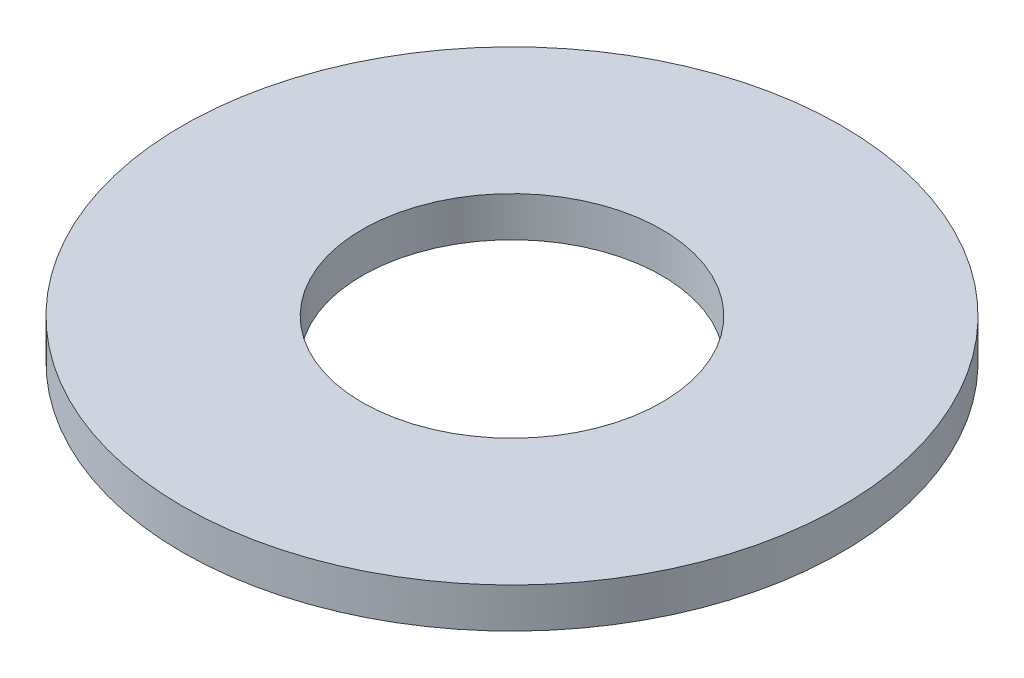
ISO-10303-21;
HEADER;
FILE_DESCRIPTION(('STEP AP214'),'2;1');
FILE_NAME('part.step','',(''),(''),'','','');
FILE_SCHEMA(('AUTOMOTIVE_DESIGN { 1 0 10303 214 1 1 1 1 }'));
ENDSEC;
DATA;
#1=APPLICATION_CONTEXT('core data for automotive mechanical design processes');
#2=APPLICATION_PROTOCOL_DEFINITION('international standard','automotive_design',2000,#1);
#3=PRODUCT_CONTEXT('',#1,'mechanical');
#4=PRODUCT('Part','Part','',(#3));
#5=PRODUCT_RELATED_PRODUCT_CATEGORY('part','',(#4));
#6=PRODUCT_DEFINITION_FORMATION('','',#4);
#7=PRODUCT_DEFINITION_CONTEXT('part definition',#1,'design');
#8=PRODUCT_DEFINITION('design','',#6,#7);
#9=PRODUCT_DEFINITION_SHAPE('','',#8);
#10=(LENGTH_UNIT() NAMED_UNIT(*) SI_UNIT(.MILLI.,.METRE.));
#11=(NAMED_UNIT(*) PLANE_ANGLE_UNIT() SI_UNIT($,.RADIAN.));
#12=(NAMED_UNIT(*) SI_UNIT($,.STERADIAN.) SOLID_ANGLE_UNIT());
#13=UNCERTAINTY_MEASURE_WITH_UNIT(LENGTH_MEASURE(1.E-05),#10,'distance_accuracy_value','');
#14=(GEOMETRIC_REPRESENTATION_CONTEXT(3) GLOBAL_UNCERTAINTY_ASSIGNED_CONTEXT((#13)) GLOBAL_UNIT_ASSIGNED_CONTEXT((#10,
#11,#12)) REPRESENTATION_CONTEXT('',''));
#15=CARTESIAN_POINT('',(0.,0.,0.));
#16=DIRECTION('',(0.,0.,1.));
#17=DIRECTION('',(1.,0.,0.));
#18=AXIS2_PLACEMENT_3D('',#15,#16,#17);
#19=CARTESIAN_POINT('',(0.,10.,0.));
#20=DIRECTION('',(0.,1.,0.));
#21=DIRECTION('',(0.,0.,1.));
#22=AXIS2_PLACEMENT_3D('',#19,#20,#21);
#23=PLANE('',#22);
#24=CARTESIAN_POINT('',(0.,10.,0.));
#25=DIRECTION('',(0.,1.,0.));
#26=DIRECTION('',(0.,0.,1.));
#27=AXIS2_PLACEMENT_3D('',#24,#25,#26);
#28=CIRCLE('',#27,82.5);
#29=CARTESIAN_POINT('',(0.,10.,82.5));
#30=VERTEX_POINT('',#29);
#31=EDGE_CURVE('E10',#30,#30,#28,.T.);
#32=ORIENTED_EDGE('',*,*,#31,.T.);
#33=EDGE_LOOP('',(#32));
#34=FACE_BOUND('',#33,.T.);
#35=CARTESIAN_POINT('',(0.,10.,0.));
#36=DIRECTION('',(0.,1.,0.));
#37=DIRECTION('',(0.,0.,1.));
#38=AXIS2_PLACEMENT_3D('',#35,#36,#37);
#39=CIRCLE('',#38,37.5);
#40=CARTESIAN_POINT('',(0.,10.,37.5));
#41=VERTEX_POINT('',#40);
#42=EDGE_CURVE('E55',#41,#41,#39,.T.);
#43=ORIENTED_EDGE('',*,*,#42,.F.);
#44=EDGE_LOOP('',(#43));
#45=FACE_BOUND('',#44,.T.);
#46=ADVANCED_FACE('F41',(#34,#45),#23,.T.);
#47=CARTESIAN_POINT('',(0.,0.,0.));
#48=DIRECTION('',(0.,1.,0.));
#49=DIRECTION('',(0.,0.,1.));
#50=AXIS2_PLACEMENT_3D('',#47,#48,#49);
#51=PLANE('',#50);
#52=CARTESIAN_POINT('',(0.,0.,0.));
#53=DIRECTION('',(0.,1.,0.));
#54=DIRECTION('',(0.,0.,1.));
#55=AXIS2_PLACEMENT_3D('',#52,#53,#54);
#56=CIRCLE('',#55,82.5);
#57=CARTESIAN_POINT('',(0.,0.,82.5));
#58=VERTEX_POINT('',#57);
#59=EDGE_CURVE('E45',#58,#58,#56,.T.);
#60=ORIENTED_EDGE('',*,*,#59,.F.);
#61=EDGE_LOOP('',(#60));
#62=FACE_BOUND('',#61,.T.);
#63=CARTESIAN_POINT('',(0.,0.,0.));
#64=DIRECTION('',(0.,1.,0.));
#65=DIRECTION('',(0.,0.,1.));
#66=AXIS2_PLACEMENT_3D('',#63,#64,#65);
#67=CIRCLE('',#66,37.5);
#68=CARTESIAN_POINT('',(0.,0.,37.5));
#69=VERTEX_POINT('',#68);
#70=EDGE_CURVE('E57',#69,#69,#67,.T.);
#71=ORIENTED_EDGE('',*,*,#70,.T.);
#72=EDGE_LOOP('',(#71));
#73=FACE_BOUND('',#72,.T.);
#74=ADVANCED_FACE('F68',(#62,#73),#51,.F.);
#75=CARTESIAN_POINT('',(0.,10.,0.));
#76=DIRECTION('',(0.,-1.,0.));
#77=DIRECTION('',(0.,0.,-1.));
#78=AXIS2_PLACEMENT_3D('',#75,#76,#77);
#79=CYLINDRICAL_SURFACE('',#78,82.5);
#80=ORIENTED_EDGE('',*,*,#31,.F.);
#81=EDGE_LOOP('',(#80));
#82=FACE_BOUND('',#81,.T.);
#83=ORIENTED_EDGE('',*,*,#59,.T.);
#84=EDGE_LOOP('',(#83));
#85=FACE_BOUND('',#84,.T.);
#86=ADVANCED_FACE('F43',(#82,#85),#79,.T.);
#87=CARTESIAN_POINT('',(0.,10.,0.));
#88=DIRECTION('',(0.,-1.,0.));
#89=DIRECTION('',(0.,0.,-1.));
#90=AXIS2_PLACEMENT_3D('',#87,#88,#89);
#91=CYLINDRICAL_SURFACE('',#90,37.5);
#92=ORIENTED_EDGE('',*,*,#42,.T.);
#93=EDGE_LOOP('',(#92));
#94=FACE_BOUND('',#93,.T.);
#95=ORIENTED_EDGE('',*,*,#70,.F.);
#96=EDGE_LOOP('',(#95));
#97=FACE_BOUND('',#96,.T.);
#98=ADVANCED_FACE('F64',(#94,#97),#91,.F.);
#99=CLOSED_SHELL('',(#46,#74,#86,#98));
#100=MANIFOLD_SOLID_BREP('B2',#99);
#101=ADVANCED_BREP_SHAPE_REPRESENTATION('',(#18,#100),#14);
#102=SHAPE_DEFINITION_REPRESENTATION(#9,#101);
ENDSEC;
END-ISO-10303-21;
